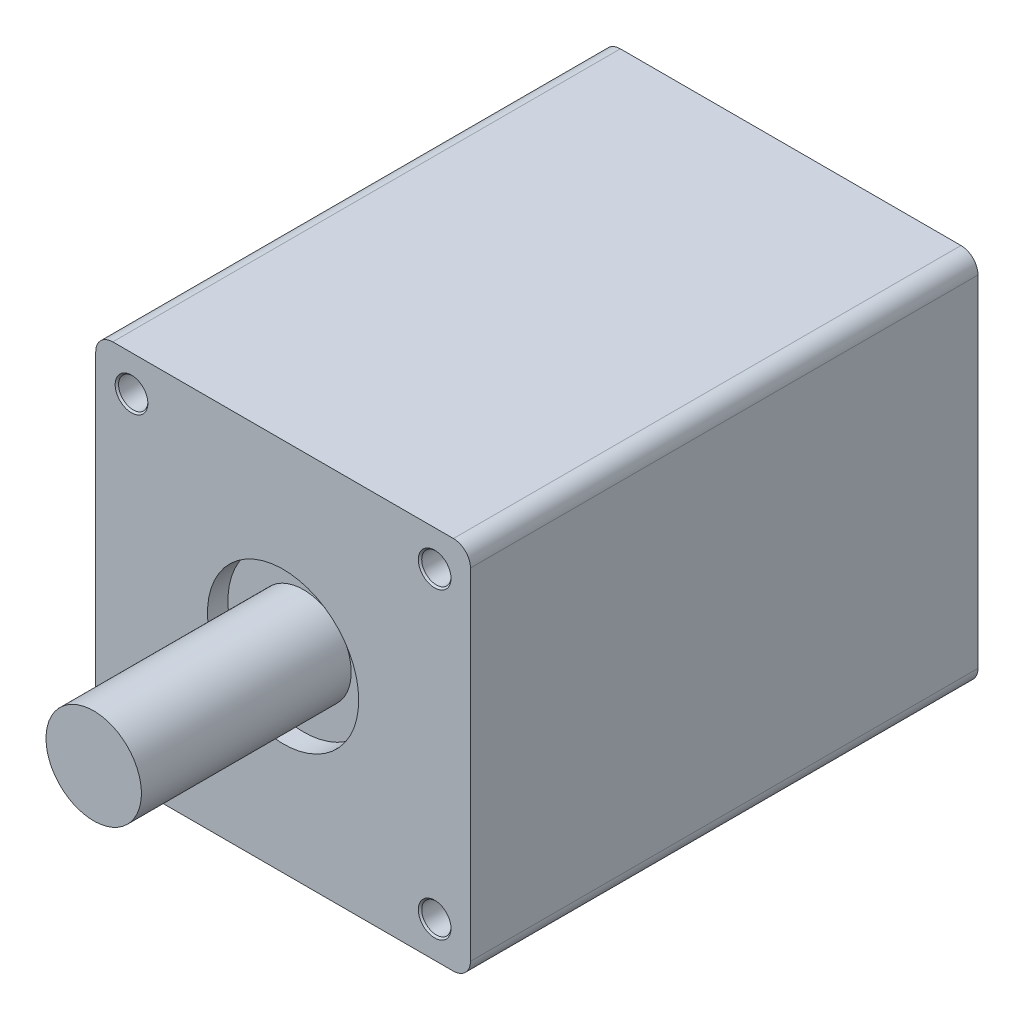
ISO-10303-21;
HEADER;
FILE_DESCRIPTION(('STEP AP214'),'2;1');
FILE_NAME('part.step','',(''),(''),'','','');
FILE_SCHEMA(('AUTOMOTIVE_DESIGN { 1 0 10303 214 1 1 1 1 }'));
ENDSEC;
DATA;
#1=APPLICATION_CONTEXT('core data for automotive mechanical design processes');
#2=APPLICATION_PROTOCOL_DEFINITION('international standard','automotive_design',2000,#1);
#3=PRODUCT_CONTEXT('',#1,'mechanical');
#4=PRODUCT('Part','Part','',(#3));
#5=PRODUCT_RELATED_PRODUCT_CATEGORY('part','',(#4));
#6=PRODUCT_DEFINITION_FORMATION('','',#4);
#7=PRODUCT_DEFINITION_CONTEXT('part definition',#1,'design');
#8=PRODUCT_DEFINITION('design','',#6,#7);
#9=PRODUCT_DEFINITION_SHAPE('','',#8);
#10=(LENGTH_UNIT() NAMED_UNIT(*) SI_UNIT(.MILLI.,.METRE.));
#11=(NAMED_UNIT(*) PLANE_ANGLE_UNIT() SI_UNIT($,.RADIAN.));
#12=(NAMED_UNIT(*) SI_UNIT($,.STERADIAN.) SOLID_ANGLE_UNIT());
#13=UNCERTAINTY_MEASURE_WITH_UNIT(LENGTH_MEASURE(1.E-05),#10,'distance_accuracy_value','');
#14=(GEOMETRIC_REPRESENTATION_CONTEXT(3) GLOBAL_UNCERTAINTY_ASSIGNED_CONTEXT((#13)) GLOBAL_UNIT_ASSIGNED_CONTEXT((#10,
#11,#12)) REPRESENTATION_CONTEXT('',''));
#15=CARTESIAN_POINT('',(0.,0.,0.));
#16=DIRECTION('',(0.,0.,1.));
#17=DIRECTION('',(1.,0.,0.));
#18=AXIS2_PLACEMENT_3D('',#15,#16,#17);
#19=CARTESIAN_POINT('',(50.,-50.,10.));
#20=DIRECTION('',(0.,0.,-1.));
#21=DIRECTION('',(-1.,0.,0.));
#22=AXIS2_PLACEMENT_3D('',#19,#20,#21);
#23=PLANE('',#22);
#24=CARTESIAN_POINT('',(-44.5,-44.5,10.));
#25=DIRECTION('',(0.,0.,-1.));
#26=DIRECTION('',(-1.,0.,0.));
#27=AXIS2_PLACEMENT_3D('',#24,#25,#26);
#28=CIRCLE('',#27,4.80000000000001);
#29=CARTESIAN_POINT('',(-49.3,-44.5,10.));
#30=VERTEX_POINT('',#29);
#31=EDGE_CURVE('E174',#30,#30,#28,.F.);
#32=ORIENTED_EDGE('',*,*,#31,.T.);
#33=EDGE_LOOP('',(#32));
#34=FACE_BOUND('',#33,.T.);
#35=ADVANCED_FACE('F59',(#34),#23,.F.);
#36=CARTESIAN_POINT('',(44.5,-44.5,10.));
#37=DIRECTION('',(0.,0.,1.));
#38=DIRECTION('',(1.,0.,0.));
#39=AXIS2_PLACEMENT_3D('',#36,#37,#38);
#40=CIRCLE('',#39,4.8);
#41=CARTESIAN_POINT('',(49.3,-44.5,10.));
#42=VERTEX_POINT('',#41);
#43=EDGE_CURVE('E195',#42,#42,#40,.T.);
#44=ORIENTED_EDGE('',*,*,#43,.T.);
#45=EDGE_LOOP('',(#44));
#46=FACE_BOUND('',#45,.T.);
#47=ADVANCED_FACE('F281',(#46),#23,.F.);
#48=CARTESIAN_POINT('',(44.5,44.5,10.));
#49=DIRECTION('',(0.,0.,-1.));
#50=DIRECTION('',(-1.,0.,0.));
#51=AXIS2_PLACEMENT_3D('',#48,#49,#50);
#52=CIRCLE('',#51,4.80000000000001);
#53=CARTESIAN_POINT('',(39.7,44.5,10.));
#54=VERTEX_POINT('',#53);
#55=EDGE_CURVE('E204',#54,#54,#52,.F.);
#56=ORIENTED_EDGE('',*,*,#55,.T.);
#57=EDGE_LOOP('',(#56));
#58=FACE_BOUND('',#57,.T.);
#59=ADVANCED_FACE('F288',(#58),#23,.F.);
#60=CARTESIAN_POINT('',(-44.5,44.5,10.));
#61=DIRECTION('',(0.,0.,1.));
#62=DIRECTION('',(1.,0.,0.));
#63=AXIS2_PLACEMENT_3D('',#60,#61,#62);
#64=CIRCLE('',#63,4.8);
#65=CARTESIAN_POINT('',(-39.7,44.5,10.));
#66=VERTEX_POINT('',#65);
#67=EDGE_CURVE('E213',#66,#66,#64,.T.);
#68=ORIENTED_EDGE('',*,*,#67,.T.);
#69=EDGE_LOOP('',(#68));
#70=FACE_BOUND('',#69,.T.);
#71=ADVANCED_FACE('F283',(#70),#23,.F.);
#72=CARTESIAN_POINT('',(-44.5,-44.5,10.5));
#73=DIRECTION('',(0.,0.,-1.));
#74=DIRECTION('',(-1.,0.,0.));
#75=AXIS2_PLACEMENT_3D('',#72,#73,#74);
#76=CONICAL_SURFACE('',#75,4.3,0.785398163397447);
#77=ORIENTED_EDGE('',*,*,#31,.F.);
#78=EDGE_LOOP('',(#77));
#79=FACE_BOUND('',#78,.T.);
#80=CARTESIAN_POINT('',(-44.5,-44.5,10.5));
#81=DIRECTION('',(0.,0.,-1.));
#82=DIRECTION('',(-1.,0.,0.));
#83=AXIS2_PLACEMENT_3D('',#80,#81,#82);
#84=CIRCLE('',#83,4.3);
#85=CARTESIAN_POINT('',(-48.8,-44.5,10.5));
#86=VERTEX_POINT('',#85);
#87=EDGE_CURVE('E171',#86,#86,#84,.T.);
#88=ORIENTED_EDGE('',*,*,#87,.F.);
#89=EDGE_LOOP('',(#88));
#90=FACE_BOUND('',#89,.T.);
#91=ADVANCED_FACE('F292',(#79,#90),#76,.F.);
#92=CARTESIAN_POINT('',(44.5,-44.5,10.));
#93=DIRECTION('',(0.,0.,-1.));
#94=DIRECTION('',(-1.,0.,0.));
#95=AXIS2_PLACEMENT_3D('',#92,#93,#94);
#96=CONICAL_SURFACE('',#95,4.8,0.785398163397461);
#97=CARTESIAN_POINT('',(44.5,-44.5,10.5));
#98=DIRECTION('',(0.,0.,1.));
#99=DIRECTION('',(1.,0.,0.));
#100=AXIS2_PLACEMENT_3D('',#97,#98,#99);
#101=CIRCLE('',#100,4.3);
#102=CARTESIAN_POINT('',(48.8,-44.5,10.5));
#103=VERTEX_POINT('',#102);
#104=EDGE_CURVE('E189',#103,#103,#101,.F.);
#105=ORIENTED_EDGE('',*,*,#104,.F.);
#106=EDGE_LOOP('',(#105));
#107=FACE_BOUND('',#106,.T.);
#108=ORIENTED_EDGE('',*,*,#43,.F.);
#109=EDGE_LOOP('',(#108));
#110=FACE_BOUND('',#109,.T.);
#111=ADVANCED_FACE('F298',(#107,#110),#96,.F.);
#112=CARTESIAN_POINT('',(44.5,44.5,10.5));
#113=DIRECTION('',(0.,0.,-1.));
#114=DIRECTION('',(-1.,0.,0.));
#115=AXIS2_PLACEMENT_3D('',#112,#113,#114);
#116=CONICAL_SURFACE('',#115,4.3,0.785398163397447);
#117=ORIENTED_EDGE('',*,*,#55,.F.);
#118=EDGE_LOOP('',(#117));
#119=FACE_BOUND('',#118,.T.);
#120=CARTESIAN_POINT('',(44.5,44.5,10.5));
#121=DIRECTION('',(0.,0.,-1.));
#122=DIRECTION('',(-1.,0.,0.));
#123=AXIS2_PLACEMENT_3D('',#120,#121,#122);
#124=CIRCLE('',#123,4.3);
#125=CARTESIAN_POINT('',(40.2,44.5,10.5));
#126=VERTEX_POINT('',#125);
#127=EDGE_CURVE('E201',#126,#126,#124,.T.);
#128=ORIENTED_EDGE('',*,*,#127,.F.);
#129=EDGE_LOOP('',(#128));
#130=FACE_BOUND('',#129,.T.);
#131=ADVANCED_FACE('F307',(#119,#130),#116,.F.);
#132=CARTESIAN_POINT('',(-44.5,44.5,10.));
#133=DIRECTION('',(0.,0.,-1.));
#134=DIRECTION('',(-1.,0.,0.));
#135=AXIS2_PLACEMENT_3D('',#132,#133,#134);
#136=CONICAL_SURFACE('',#135,4.8,0.785398163397461);
#137=CARTESIAN_POINT('',(-44.5,44.5,10.5));
#138=DIRECTION('',(0.,0.,1.));
#139=DIRECTION('',(1.,0.,0.));
#140=AXIS2_PLACEMENT_3D('',#137,#138,#139);
#141=CIRCLE('',#140,4.3);
#142=CARTESIAN_POINT('',(-40.2,44.5,10.5));
#143=VERTEX_POINT('',#142);
#144=EDGE_CURVE('E207',#143,#143,#141,.F.);
#145=ORIENTED_EDGE('',*,*,#144,.F.);
#146=EDGE_LOOP('',(#145));
#147=FACE_BOUND('',#146,.T.);
#148=ORIENTED_EDGE('',*,*,#67,.F.);
#149=EDGE_LOOP('',(#148));
#150=FACE_BOUND('',#149,.T.);
#151=ADVANCED_FACE('F304',(#147,#150),#136,.F.);
#152=CARTESIAN_POINT('',(-44.5,-44.5,22.));
#153=DIRECTION('',(0.,0.,-1.));
#154=DIRECTION('',(-1.,0.,0.));
#155=AXIS2_PLACEMENT_3D('',#152,#153,#154);
#156=CYLINDRICAL_SURFACE('',#155,4.3);
#157=ORIENTED_EDGE('',*,*,#87,.T.);
#158=EDGE_LOOP('',(#157));
#159=FACE_BOUND('',#158,.T.);
#160=CARTESIAN_POINT('',(-44.5,-44.5,21.5));
#161=DIRECTION('',(0.,0.,1.));
#162=DIRECTION('',(1.,0.,0.));
#163=AXIS2_PLACEMENT_3D('',#160,#161,#162);
#164=CIRCLE('',#163,4.3);
#165=CARTESIAN_POINT('',(-40.2,-44.5,21.5));
#166=VERTEX_POINT('',#165);
#167=EDGE_CURVE('E168',#166,#166,#164,.T.);
#168=ORIENTED_EDGE('',*,*,#167,.T.);
#169=EDGE_LOOP('',(#168));
#170=FACE_BOUND('',#169,.T.);
#171=ADVANCED_FACE('F306',(#159,#170),#156,.F.);
#172=CARTESIAN_POINT('',(44.5,-44.5,22.));
#173=DIRECTION('',(0.,0.,-1.));
#174=DIRECTION('',(-1.,0.,0.));
#175=AXIS2_PLACEMENT_3D('',#172,#173,#174);
#176=CYLINDRICAL_SURFACE('',#175,4.3);
#177=CARTESIAN_POINT('',(44.5,-44.5,21.5));
#178=DIRECTION('',(0.,0.,1.));
#179=DIRECTION('',(1.,0.,0.));
#180=AXIS2_PLACEMENT_3D('',#177,#178,#179);
#181=CIRCLE('',#180,4.3);
#182=CARTESIAN_POINT('',(48.8,-44.5,21.5));
#183=VERTEX_POINT('',#182);
#184=EDGE_CURVE('E192',#183,#183,#181,.T.);
#185=ORIENTED_EDGE('',*,*,#184,.T.);
#186=EDGE_LOOP('',(#185));
#187=FACE_BOUND('',#186,.T.);
#188=ORIENTED_EDGE('',*,*,#104,.T.);
#189=EDGE_LOOP('',(#188));
#190=FACE_BOUND('',#189,.T.);
#191=ADVANCED_FACE('F313',(#187,#190),#176,.F.);
#192=CARTESIAN_POINT('',(44.5,44.5,22.));
#193=DIRECTION('',(0.,0.,-1.));
#194=DIRECTION('',(-1.,0.,0.));
#195=AXIS2_PLACEMENT_3D('',#192,#193,#194);
#196=CYLINDRICAL_SURFACE('',#195,4.3);
#197=ORIENTED_EDGE('',*,*,#127,.T.);
#198=EDGE_LOOP('',(#197));
#199=FACE_BOUND('',#198,.T.);
#200=CARTESIAN_POINT('',(44.5,44.5,21.5));
#201=DIRECTION('',(0.,0.,1.));
#202=DIRECTION('',(1.,0.,0.));
#203=AXIS2_PLACEMENT_3D('',#200,#201,#202);
#204=CIRCLE('',#203,4.3);
#205=CARTESIAN_POINT('',(48.8,44.5,21.5));
#206=VERTEX_POINT('',#205);
#207=EDGE_CURVE('E198',#206,#206,#204,.T.);
#208=ORIENTED_EDGE('',*,*,#207,.T.);
#209=EDGE_LOOP('',(#208));
#210=FACE_BOUND('',#209,.T.);
#211=ADVANCED_FACE('F345',(#199,#210),#196,.F.);
#212=CARTESIAN_POINT('',(-44.5,44.5,22.));
#213=DIRECTION('',(0.,0.,-1.));
#214=DIRECTION('',(-1.,0.,0.));
#215=AXIS2_PLACEMENT_3D('',#212,#213,#214);
#216=CYLINDRICAL_SURFACE('',#215,4.3);
#217=CARTESIAN_POINT('',(-44.5,44.5,21.5));
#218=DIRECTION('',(0.,0.,1.));
#219=DIRECTION('',(1.,0.,0.));
#220=AXIS2_PLACEMENT_3D('',#217,#218,#219);
#221=CIRCLE('',#220,4.3);
#222=CARTESIAN_POINT('',(-40.2,44.5,21.5));
#223=VERTEX_POINT('',#222);
#224=EDGE_CURVE('E210',#223,#223,#221,.T.);
#225=ORIENTED_EDGE('',*,*,#224,.T.);
#226=EDGE_LOOP('',(#225));
#227=FACE_BOUND('',#226,.T.);
#228=ORIENTED_EDGE('',*,*,#144,.T.);
#229=EDGE_LOOP('',(#228));
#230=FACE_BOUND('',#229,.T.);
#231=ADVANCED_FACE('F342',(#227,#230),#216,.F.);
#232=CARTESIAN_POINT('',(-51.,-32.6,-127.));
#233=DIRECTION('',(0.,0.,-1.));
#234=DIRECTION('',(-1.,0.,0.));
#235=AXIS2_PLACEMENT_3D('',#232,#233,#234);
#236=PLANE('',#235);
#237=CARTESIAN_POINT('',(-50.,-50.,-127.));
#238=DIRECTION('',(0.,0.,-1.));
#239=DIRECTION('',(-1.,0.,0.));
#240=AXIS2_PLACEMENT_3D('',#237,#238,#239);
#241=CIRCLE('',#240,5.);
#242=CARTESIAN_POINT('',(-50.,-55.,-127.));
#243=VERTEX_POINT('',#242);
#244=CARTESIAN_POINT('',(-55.,-50.,-127.));
#245=VERTEX_POINT('',#244);
#246=EDGE_CURVE('E221',#243,#245,#241,.T.);
#247=ORIENTED_EDGE('',*,*,#246,.T.);
#248=DIRECTION('',(0.,1.,0.));
#249=VECTOR('',#248,1.);
#250=CARTESIAN_POINT('',(-55.,-32.6,-127.));
#251=LINE('',#250,#249);
#252=CARTESIAN_POINT('',(-55.,50.,-127.));
#253=VERTEX_POINT('',#252);
#254=EDGE_CURVE('E241',#245,#253,#251,.T.);
#255=ORIENTED_EDGE('',*,*,#254,.T.);
#256=CARTESIAN_POINT('',(-50.,50.,-127.));
#257=DIRECTION('',(0.,0.,-1.));
#258=DIRECTION('',(1.,0.,0.));
#259=AXIS2_PLACEMENT_3D('',#256,#257,#258);
#260=CIRCLE('',#259,5.);
#261=CARTESIAN_POINT('',(-50.,55.,-127.));
#262=VERTEX_POINT('',#261);
#263=EDGE_CURVE('E224',#253,#262,#260,.T.);
#264=ORIENTED_EDGE('',*,*,#263,.T.);
#265=DIRECTION('',(1.,0.,0.));
#266=VECTOR('',#265,1.);
#267=CARTESIAN_POINT('',(-32.6,55.,-127.));
#268=LINE('',#267,#266);
#269=CARTESIAN_POINT('',(50.,55.,-127.));
#270=VERTEX_POINT('',#269);
#271=EDGE_CURVE('E243',#262,#270,#268,.T.);
#272=ORIENTED_EDGE('',*,*,#271,.T.);
#273=CARTESIAN_POINT('',(50.,50.,-127.));
#274=DIRECTION('',(0.,0.,-1.));
#275=DIRECTION('',(-1.,0.,0.));
#276=AXIS2_PLACEMENT_3D('',#273,#274,#275);
#277=CIRCLE('',#276,5.);
#278=CARTESIAN_POINT('',(55.,50.,-127.));
#279=VERTEX_POINT('',#278);
#280=EDGE_CURVE('E130',#270,#279,#277,.T.);
#281=ORIENTED_EDGE('',*,*,#280,.T.);
#282=DIRECTION('',(0.,-1.,0.));
#283=VECTOR('',#282,1.);
#284=CARTESIAN_POINT('',(55.,32.6,-127.));
#285=LINE('',#284,#283);
#286=CARTESIAN_POINT('',(55.,-50.,-127.));
#287=VERTEX_POINT('',#286);
#288=EDGE_CURVE('E74',#279,#287,#285,.T.);
#289=ORIENTED_EDGE('',*,*,#288,.T.);
#290=CARTESIAN_POINT('',(50.,-50.,-127.));
#291=DIRECTION('',(0.,0.,-1.));
#292=DIRECTION('',(-1.,0.,0.));
#293=AXIS2_PLACEMENT_3D('',#290,#291,#292);
#294=CIRCLE('',#293,5.);
#295=CARTESIAN_POINT('',(50.,-55.,-127.));
#296=VERTEX_POINT('',#295);
#297=EDGE_CURVE('E128',#287,#296,#294,.T.);
#298=ORIENTED_EDGE('',*,*,#297,.T.);
#299=DIRECTION('',(-1.,0.,0.));
#300=VECTOR('',#299,1.);
#301=CARTESIAN_POINT('',(32.6,-55.,-127.));
#302=LINE('',#301,#300);
#303=EDGE_CURVE('E67',#296,#243,#302,.T.);
#304=ORIENTED_EDGE('',*,*,#303,.T.);
#305=EDGE_LOOP('',(#247,#255,#264,#272,#281,#289,#298,#304));
#306=FACE_BOUND('',#305,.T.);
#307=ADVANCED_FACE('F246',(#306),#236,.T.);
#308=CARTESIAN_POINT('',(-44.5,-44.5,21.5));
#309=DIRECTION('',(0.,0.,1.));
#310=DIRECTION('',(1.,0.,0.));
#311=AXIS2_PLACEMENT_3D('',#308,#309,#310);
#312=CONICAL_SURFACE('',#311,4.3,0.785398163397444);
#313=CARTESIAN_POINT('',(-44.5,-44.5,22.));
#314=DIRECTION('',(0.,0.,1.));
#315=DIRECTION('',(1.,0.,0.));
#316=AXIS2_PLACEMENT_3D('',#313,#314,#315);
#317=CIRCLE('',#316,4.80000000000003);
#318=CARTESIAN_POINT('',(-39.7,-44.5,22.));
#319=VERTEX_POINT('',#318);
#320=EDGE_CURVE('E186',#319,#319,#317,.F.);
#321=ORIENTED_EDGE('',*,*,#320,.F.);
#322=EDGE_LOOP('',(#321));
#323=FACE_BOUND('',#322,.T.);
#324=ORIENTED_EDGE('',*,*,#167,.F.);
#325=EDGE_LOOP('',(#324));
#326=FACE_BOUND('',#325,.T.);
#327=ADVANCED_FACE('F334',(#323,#326),#312,.F.);
#328=CARTESIAN_POINT('',(44.5,-44.5,21.5));
#329=DIRECTION('',(0.,0.,1.));
#330=DIRECTION('',(1.,0.,0.));
#331=AXIS2_PLACEMENT_3D('',#328,#329,#330);
#332=CONICAL_SURFACE('',#331,4.3,0.785398163397458);
#333=CARTESIAN_POINT('',(44.5,-44.5,22.));
#334=DIRECTION('',(0.,0.,1.));
#335=DIRECTION('',(1.,0.,0.));
#336=AXIS2_PLACEMENT_3D('',#333,#334,#335);
#337=CIRCLE('',#336,4.8);
#338=CARTESIAN_POINT('',(49.3,-44.5,22.));
#339=VERTEX_POINT('',#338);
#340=EDGE_CURVE('E183',#339,#339,#337,.F.);
#341=ORIENTED_EDGE('',*,*,#340,.F.);
#342=EDGE_LOOP('',(#341));
#343=FACE_BOUND('',#342,.T.);
#344=ORIENTED_EDGE('',*,*,#184,.F.);
#345=EDGE_LOOP('',(#344));
#346=FACE_BOUND('',#345,.T.);
#347=ADVANCED_FACE('F326',(#343,#346),#332,.F.);
#348=CARTESIAN_POINT('',(44.5,44.5,21.5));
#349=DIRECTION('',(0.,0.,1.));
#350=DIRECTION('',(1.,0.,0.));
#351=AXIS2_PLACEMENT_3D('',#348,#349,#350);
#352=CONICAL_SURFACE('',#351,4.3,0.785398163397458);
#353=CARTESIAN_POINT('',(44.5,44.5,22.));
#354=DIRECTION('',(0.,0.,1.));
#355=DIRECTION('',(1.,0.,0.));
#356=AXIS2_PLACEMENT_3D('',#353,#354,#355);
#357=CIRCLE('',#356,4.8);
#358=CARTESIAN_POINT('',(49.3,44.5,22.));
#359=VERTEX_POINT('',#358);
#360=EDGE_CURVE('E180',#359,#359,#357,.F.);
#361=ORIENTED_EDGE('',*,*,#360,.F.);
#362=EDGE_LOOP('',(#361));
#363=FACE_BOUND('',#362,.T.);
#364=ORIENTED_EDGE('',*,*,#207,.F.);
#365=EDGE_LOOP('',(#364));
#366=FACE_BOUND('',#365,.T.);
#367=ADVANCED_FACE('F323',(#363,#366),#352,.F.);
#368=CARTESIAN_POINT('',(-44.5,44.5,21.5));
#369=DIRECTION('',(0.,0.,1.));
#370=DIRECTION('',(1.,0.,0.));
#371=AXIS2_PLACEMENT_3D('',#368,#369,#370);
#372=CONICAL_SURFACE('',#371,4.3,0.785398163397458);
#373=CARTESIAN_POINT('',(-44.5,44.5,22.));
#374=DIRECTION('',(0.,0.,1.));
#375=DIRECTION('',(1.,0.,0.));
#376=AXIS2_PLACEMENT_3D('',#373,#374,#375);
#377=CIRCLE('',#376,4.8);
#378=CARTESIAN_POINT('',(-39.7,44.5,22.));
#379=VERTEX_POINT('',#378);
#380=EDGE_CURVE('E177',#379,#379,#377,.F.);
#381=ORIENTED_EDGE('',*,*,#380,.F.);
#382=EDGE_LOOP('',(#381));
#383=FACE_BOUND('',#382,.T.);
#384=ORIENTED_EDGE('',*,*,#224,.F.);
#385=EDGE_LOOP('',(#384));
#386=FACE_BOUND('',#385,.T.);
#387=ADVANCED_FACE('F320',(#383,#386),#372,.F.);
#388=CARTESIAN_POINT('',(-50.,50.,-127.));
#389=DIRECTION('',(0.,0.,1.));
#390=DIRECTION('',(1.,0.,0.));
#391=AXIS2_PLACEMENT_3D('',#388,#389,#390);
#392=CYLINDRICAL_SURFACE('',#391,5.);
#393=DIRECTION('',(0.,0.,1.));
#394=VECTOR('',#393,1.);
#395=CARTESIAN_POINT('',(-55.,50.,-127.));
#396=LINE('',#395,#394);
#397=CARTESIAN_POINT('',(-55.,50.,22.));
#398=VERTEX_POINT('',#397);
#399=EDGE_CURVE('E233',#253,#398,#396,.T.);
#400=ORIENTED_EDGE('',*,*,#399,.T.);
#401=CARTESIAN_POINT('',(-50.,50.,22.));
#402=DIRECTION('',(0.,0.,1.));
#403=DIRECTION('',(1.,0.,0.));
#404=AXIS2_PLACEMENT_3D('',#401,#402,#403);
#405=CIRCLE('',#404,5.);
#406=CARTESIAN_POINT('',(-50.,55.,22.));
#407=VERTEX_POINT('',#406);
#408=EDGE_CURVE('E160',#407,#398,#405,.T.);
#409=ORIENTED_EDGE('',*,*,#408,.F.);
#410=DIRECTION('',(0.,0.,1.));
#411=VECTOR('',#410,1.);
#412=CARTESIAN_POINT('',(-50.,55.,-127.));
#413=LINE('',#412,#411);
#414=EDGE_CURVE('E231',#262,#407,#413,.T.);
#415=ORIENTED_EDGE('',*,*,#414,.F.);
#416=ORIENTED_EDGE('',*,*,#263,.F.);
#417=EDGE_LOOP('',(#400,#409,#415,#416));
#418=FACE_BOUND('',#417,.T.);
#419=ADVANCED_FACE('F262',(#418),#392,.T.);
#420=CARTESIAN_POINT('',(-32.6,55.,-127.));
#421=DIRECTION('',(0.,-1.,0.));
#422=DIRECTION('',(0.,0.,-1.));
#423=AXIS2_PLACEMENT_3D('',#420,#421,#422);
#424=PLANE('',#423);
#425=DIRECTION('',(0.,0.,1.));
#426=VECTOR('',#425,1.);
#427=CARTESIAN_POINT('',(50.,55.,-127.));
#428=LINE('',#427,#426);
#429=CARTESIAN_POINT('',(50.,55.,22.));
#430=VERTEX_POINT('',#429);
#431=EDGE_CURVE('E229',#270,#430,#428,.T.);
#432=ORIENTED_EDGE('',*,*,#431,.F.);
#433=ORIENTED_EDGE('',*,*,#271,.F.);
#434=ORIENTED_EDGE('',*,*,#414,.T.);
#435=DIRECTION('',(-1.,0.,0.));
#436=VECTOR('',#435,1.);
#437=CARTESIAN_POINT('',(50.,55.,22.));
#438=LINE('',#437,#436);
#439=EDGE_CURVE('E157',#430,#407,#438,.T.);
#440=ORIENTED_EDGE('',*,*,#439,.F.);
#441=EDGE_LOOP('',(#432,#433,#434,#440));
#442=FACE_BOUND('',#441,.T.);
#443=ADVANCED_FACE('F267',(#442),#424,.F.);
#444=CARTESIAN_POINT('',(50.,50.,-127.));
#445=DIRECTION('',(0.,0.,1.));
#446=DIRECTION('',(1.,0.,0.));
#447=AXIS2_PLACEMENT_3D('',#444,#445,#446);
#448=CYLINDRICAL_SURFACE('',#447,5.);
#449=ORIENTED_EDGE('',*,*,#431,.T.);
#450=CARTESIAN_POINT('',(50.,50.,22.));
#451=DIRECTION('',(0.,0.,1.));
#452=DIRECTION('',(1.,0.,0.));
#453=AXIS2_PLACEMENT_3D('',#450,#451,#452);
#454=CIRCLE('',#453,5.);
#455=CARTESIAN_POINT('',(55.,50.,22.));
#456=VERTEX_POINT('',#455);
#457=EDGE_CURVE('E139',#456,#430,#454,.T.);
#458=ORIENTED_EDGE('',*,*,#457,.F.);
#459=DIRECTION('',(0.,0.,1.));
#460=VECTOR('',#459,1.);
#461=CARTESIAN_POINT('',(55.,50.,-127.));
#462=LINE('',#461,#460);
#463=EDGE_CURVE('E129',#279,#456,#462,.T.);
#464=ORIENTED_EDGE('',*,*,#463,.F.);
#465=ORIENTED_EDGE('',*,*,#280,.F.);
#466=EDGE_LOOP('',(#449,#458,#464,#465));
#467=FACE_BOUND('',#466,.T.);
#468=ADVANCED_FACE('F269',(#467),#448,.T.);
#469=CARTESIAN_POINT('',(55.,32.6,-127.));
#470=DIRECTION('',(-1.,0.,0.));
#471=DIRECTION('',(0.,-1.,0.));
#472=AXIS2_PLACEMENT_3D('',#469,#470,#471);
#473=PLANE('',#472);
#474=DIRECTION('',(0.,1.,0.));
#475=VECTOR('',#474,1.);
#476=CARTESIAN_POINT('',(55.,-50.,22.));
#477=LINE('',#476,#475);
#478=CARTESIAN_POINT('',(55.,-50.,22.));
#479=VERTEX_POINT('',#478);
#480=EDGE_CURVE('E133',#479,#456,#477,.T.);
#481=ORIENTED_EDGE('',*,*,#480,.F.);
#482=DIRECTION('',(0.,0.,1.));
#483=VECTOR('',#482,1.);
#484=CARTESIAN_POINT('',(55.,-50.,-127.));
#485=LINE('',#484,#483);
#486=EDGE_CURVE('E122',#287,#479,#485,.T.);
#487=ORIENTED_EDGE('',*,*,#486,.F.);
#488=ORIENTED_EDGE('',*,*,#288,.F.);
#489=ORIENTED_EDGE('',*,*,#463,.T.);
#490=EDGE_LOOP('',(#481,#487,#488,#489));
#491=FACE_BOUND('',#490,.T.);
#492=ADVANCED_FACE('F134',(#491),#473,.F.);
#493=CARTESIAN_POINT('',(50.,-50.,-127.));
#494=DIRECTION('',(0.,0.,1.));
#495=DIRECTION('',(1.,0.,0.));
#496=AXIS2_PLACEMENT_3D('',#493,#494,#495);
#497=CYLINDRICAL_SURFACE('',#496,5.);
#498=ORIENTED_EDGE('',*,*,#486,.T.);
#499=CARTESIAN_POINT('',(50.,-50.,22.));
#500=DIRECTION('',(0.,0.,1.));
#501=DIRECTION('',(1.,0.,0.));
#502=AXIS2_PLACEMENT_3D('',#499,#500,#501);
#503=CIRCLE('',#502,5.);
#504=CARTESIAN_POINT('',(50.,-55.,22.));
#505=VERTEX_POINT('',#504);
#506=EDGE_CURVE('E127',#505,#479,#503,.T.);
#507=ORIENTED_EDGE('',*,*,#506,.F.);
#508=DIRECTION('',(0.,0.,1.));
#509=VECTOR('',#508,1.);
#510=CARTESIAN_POINT('',(50.,-55.,-127.));
#511=LINE('',#510,#509);
#512=EDGE_CURVE('E239',#296,#505,#511,.T.);
#513=ORIENTED_EDGE('',*,*,#512,.F.);
#514=ORIENTED_EDGE('',*,*,#297,.F.);
#515=EDGE_LOOP('',(#498,#507,#513,#514));
#516=FACE_BOUND('',#515,.T.);
#517=ADVANCED_FACE('F124',(#516),#497,.T.);
#518=CARTESIAN_POINT('',(32.6,-55.,-127.));
#519=DIRECTION('',(0.,1.,0.));
#520=DIRECTION('',(0.,0.,1.));
#521=AXIS2_PLACEMENT_3D('',#518,#519,#520);
#522=PLANE('',#521);
#523=ORIENTED_EDGE('',*,*,#512,.T.);
#524=DIRECTION('',(1.,0.,0.));
#525=VECTOR('',#524,1.);
#526=CARTESIAN_POINT('',(50.,-55.,22.));
#527=LINE('',#526,#525);
#528=CARTESIAN_POINT('',(-50.,-55.,22.));
#529=VERTEX_POINT('',#528);
#530=EDGE_CURVE('E147',#529,#505,#527,.T.);
#531=ORIENTED_EDGE('',*,*,#530,.F.);
#532=DIRECTION('',(0.,0.,1.));
#533=VECTOR('',#532,1.);
#534=CARTESIAN_POINT('',(-50.,-55.,-127.));
#535=LINE('',#534,#533);
#536=EDGE_CURVE('E237',#243,#529,#535,.T.);
#537=ORIENTED_EDGE('',*,*,#536,.F.);
#538=ORIENTED_EDGE('',*,*,#303,.F.);
#539=EDGE_LOOP('',(#523,#531,#537,#538));
#540=FACE_BOUND('',#539,.T.);
#541=ADVANCED_FACE('F250',(#540),#522,.F.);
#542=CARTESIAN_POINT('',(-50.,-50.,-127.));
#543=DIRECTION('',(0.,0.,1.));
#544=DIRECTION('',(1.,0.,0.));
#545=AXIS2_PLACEMENT_3D('',#542,#543,#544);
#546=CYLINDRICAL_SURFACE('',#545,5.);
#547=ORIENTED_EDGE('',*,*,#536,.T.);
#548=CARTESIAN_POINT('',(-50.,-50.,22.));
#549=DIRECTION('',(0.,0.,1.));
#550=DIRECTION('',(-1.,0.,0.));
#551=AXIS2_PLACEMENT_3D('',#548,#549,#550);
#552=CIRCLE('',#551,5.);
#553=CARTESIAN_POINT('',(-55.,-50.,22.));
#554=VERTEX_POINT('',#553);
#555=EDGE_CURVE('E165',#554,#529,#552,.T.);
#556=ORIENTED_EDGE('',*,*,#555,.F.);
#557=DIRECTION('',(0.,0.,1.));
#558=VECTOR('',#557,1.);
#559=CARTESIAN_POINT('',(-55.,-50.,-127.));
#560=LINE('',#559,#558);
#561=EDGE_CURVE('E235',#245,#554,#560,.T.);
#562=ORIENTED_EDGE('',*,*,#561,.F.);
#563=ORIENTED_EDGE('',*,*,#246,.F.);
#564=EDGE_LOOP('',(#547,#556,#562,#563));
#565=FACE_BOUND('',#564,.T.);
#566=ADVANCED_FACE('F253',(#565),#546,.T.);
#567=CARTESIAN_POINT('',(-55.,-32.6,-127.));
#568=DIRECTION('',(1.,0.,0.));
#569=DIRECTION('',(0.,1.,0.));
#570=AXIS2_PLACEMENT_3D('',#567,#568,#569);
#571=PLANE('',#570);
#572=ORIENTED_EDGE('',*,*,#561,.T.);
#573=DIRECTION('',(0.,-1.,0.));
#574=VECTOR('',#573,1.);
#575=CARTESIAN_POINT('',(-55.,-50.,22.));
#576=LINE('',#575,#574);
#577=EDGE_CURVE('E163',#398,#554,#576,.T.);
#578=ORIENTED_EDGE('',*,*,#577,.F.);
#579=ORIENTED_EDGE('',*,*,#399,.F.);
#580=ORIENTED_EDGE('',*,*,#254,.F.);
#581=EDGE_LOOP('',(#572,#578,#579,#580));
#582=FACE_BOUND('',#581,.T.);
#583=ADVANCED_FACE('F256',(#582),#571,.F.);
#584=CARTESIAN_POINT('',(50.,-50.,22.));
#585=DIRECTION('',(0.,0.,1.));
#586=DIRECTION('',(1.,0.,0.));
#587=AXIS2_PLACEMENT_3D('',#584,#585,#586);
#588=PLANE('',#587);
#589=ORIENTED_EDGE('',*,*,#577,.T.);
#590=ORIENTED_EDGE('',*,*,#555,.T.);
#591=ORIENTED_EDGE('',*,*,#530,.T.);
#592=ORIENTED_EDGE('',*,*,#506,.T.);
#593=ORIENTED_EDGE('',*,*,#480,.T.);
#594=ORIENTED_EDGE('',*,*,#457,.T.);
#595=ORIENTED_EDGE('',*,*,#439,.T.);
#596=ORIENTED_EDGE('',*,*,#408,.T.);
#597=EDGE_LOOP('',(#589,#590,#591,#592,#593,#594,#595,#596));
#598=FACE_BOUND('',#597,.T.);
#599=ORIENTED_EDGE('',*,*,#380,.T.);
#600=EDGE_LOOP('',(#599));
#601=FACE_BOUND('',#600,.T.);
#602=ORIENTED_EDGE('',*,*,#360,.T.);
#603=EDGE_LOOP('',(#602));
#604=FACE_BOUND('',#603,.T.);
#605=ORIENTED_EDGE('',*,*,#340,.T.);
#606=EDGE_LOOP('',(#605));
#607=FACE_BOUND('',#606,.T.);
#608=ORIENTED_EDGE('',*,*,#320,.T.);
#609=EDGE_LOOP('',(#608));
#610=FACE_BOUND('',#609,.T.);
#611=CARTESIAN_POINT('',(0.,0.,22.));
#612=DIRECTION('',(0.,0.,1.));
#613=DIRECTION('',(1.,0.,0.));
#614=AXIS2_PLACEMENT_3D('',#611,#612,#613);
#615=CIRCLE('',#614,22.2);
#616=CARTESIAN_POINT('',(22.2,0.,22.));
#617=VERTEX_POINT('',#616);
#618=EDGE_CURVE('E152',#617,#617,#615,.T.);
#619=ORIENTED_EDGE('',*,*,#618,.F.);
#620=EDGE_LOOP('',(#619));
#621=FACE_BOUND('',#620,.T.);
#622=ADVANCED_FACE('F143',(#598,#601,#604,#607,#610,#621),#588,.T.);
#623=CARTESIAN_POINT('',(0.,0.,77.6));
#624=DIRECTION('',(0.,0.,1.));
#625=DIRECTION('',(1.,0.,0.));
#626=AXIS2_PLACEMENT_3D('',#623,#624,#625);
#627=PLANE('',#626);
#628=CARTESIAN_POINT('',(0.,0.,77.6));
#629=DIRECTION('',(0.,0.,1.));
#630=DIRECTION('',(1.,0.,0.));
#631=AXIS2_PLACEMENT_3D('',#628,#629,#630);
#632=CIRCLE('',#631,14.);
#633=CARTESIAN_POINT('',(-14.,0.,77.6));
#634=VERTEX_POINT('',#633);
#635=EDGE_CURVE('E12',#634,#634,#632,.T.);
#636=ORIENTED_EDGE('',*,*,#635,.T.);
#637=EDGE_LOOP('',(#636));
#638=FACE_BOUND('',#637,.T.);
#639=ADVANCED_FACE('F341',(#638),#627,.T.);
#640=CARTESIAN_POINT('',(0.,0.,77.6));
#641=DIRECTION('',(0.,0.,-1.));
#642=DIRECTION('',(-1.,0.,0.));
#643=AXIS2_PLACEMENT_3D('',#640,#641,#642);
#644=CYLINDRICAL_SURFACE('',#643,14.);
#645=CARTESIAN_POINT('',(0.,0.,16.));
#646=DIRECTION('',(0.,0.,-1.));
#647=DIRECTION('',(-1.,0.,0.));
#648=AXIS2_PLACEMENT_3D('',#645,#646,#647);
#649=CIRCLE('',#648,14.);
#650=CARTESIAN_POINT('',(-14.,0.,16.));
#651=VERTEX_POINT('',#650);
#652=EDGE_CURVE('E216',#651,#651,#649,.F.);
#653=CARTESIAN_POINT('',(-14.,0.,77.6));
#654=CARTESIAN_POINT('',(-14.,0.,76.9583333333333));
#655=CARTESIAN_POINT('',(-14.,0.,76.3166666666667));
#656=CARTESIAN_POINT('',(-14.,0.,75.0333333333333));
#657=CARTESIAN_POINT('',(-14.,0.,74.3916666666667));
#658=CARTESIAN_POINT('',(-14.,0.,73.1083333333333));
#659=CARTESIAN_POINT('',(-14.,0.,72.4666666666667));
#660=CARTESIAN_POINT('',(-14.,0.,71.1833333333333));
#661=CARTESIAN_POINT('',(-14.,0.,70.5416666666667));
#662=CARTESIAN_POINT('',(-14.,0.,69.2583333333333));
#663=CARTESIAN_POINT('',(-14.,0.,68.6166666666667));
#664=CARTESIAN_POINT('',(-14.,0.,67.3333333333333));
#665=CARTESIAN_POINT('',(-14.,0.,66.6916666666667));
#666=CARTESIAN_POINT('',(-14.,0.,65.4083333333333));
#667=CARTESIAN_POINT('',(-14.,0.,64.7666666666667));
#668=CARTESIAN_POINT('',(-14.,0.,63.4833333333333));
#669=CARTESIAN_POINT('',(-14.,0.,62.8416666666667));
#670=CARTESIAN_POINT('',(-14.,0.,61.5583333333333));
#671=CARTESIAN_POINT('',(-14.,0.,60.9166666666667));
#672=CARTESIAN_POINT('',(-14.,0.,59.6333333333333));
#673=CARTESIAN_POINT('',(-14.,0.,58.9916666666667));
#674=CARTESIAN_POINT('',(-14.,0.,57.7083333333333));
#675=CARTESIAN_POINT('',(-14.,0.,57.0666666666667));
#676=CARTESIAN_POINT('',(-14.,0.,55.7833333333333));
#677=CARTESIAN_POINT('',(-14.,0.,55.1416666666667));
#678=CARTESIAN_POINT('',(-14.,0.,53.8583333333333));
#679=CARTESIAN_POINT('',(-14.,0.,53.2166666666667));
#680=CARTESIAN_POINT('',(-14.,0.,51.9333333333333));
#681=CARTESIAN_POINT('',(-14.,0.,51.2916666666667));
#682=CARTESIAN_POINT('',(-14.,0.,50.0083333333333));
#683=CARTESIAN_POINT('',(-14.,0.,49.3666666666667));
#684=CARTESIAN_POINT('',(-14.,0.,48.0833333333333));
#685=CARTESIAN_POINT('',(-14.,0.,47.4416666666667));
#686=CARTESIAN_POINT('',(-14.,0.,46.1583333333333));
#687=CARTESIAN_POINT('',(-14.,0.,45.5166666666667));
#688=CARTESIAN_POINT('',(-14.,0.,44.2333333333333));
#689=CARTESIAN_POINT('',(-14.,0.,43.5916666666667));
#690=CARTESIAN_POINT('',(-14.,0.,42.3083333333333));
#691=CARTESIAN_POINT('',(-14.,0.,41.6666666666667));
#692=CARTESIAN_POINT('',(-14.,0.,40.3833333333333));
#693=CARTESIAN_POINT('',(-14.,0.,39.7416666666667));
#694=CARTESIAN_POINT('',(-14.,0.,38.4583333333333));
#695=CARTESIAN_POINT('',(-14.,0.,37.8166666666667));
#696=CARTESIAN_POINT('',(-14.,0.,36.5333333333333));
#697=CARTESIAN_POINT('',(-14.,0.,35.8916666666667));
#698=CARTESIAN_POINT('',(-14.,0.,34.6083333333333));
#699=CARTESIAN_POINT('',(-14.,0.,33.9666666666667));
#700=CARTESIAN_POINT('',(-14.,0.,32.6833333333333));
#701=CARTESIAN_POINT('',(-14.,0.,32.0416666666667));
#702=CARTESIAN_POINT('',(-14.,0.,30.7583333333333));
#703=CARTESIAN_POINT('',(-14.,0.,30.1166666666667));
#704=CARTESIAN_POINT('',(-14.,0.,28.8333333333333));
#705=CARTESIAN_POINT('',(-14.,0.,28.1916666666667));
#706=CARTESIAN_POINT('',(-14.,0.,26.9083333333333));
#707=CARTESIAN_POINT('',(-14.,0.,26.2666666666667));
#708=CARTESIAN_POINT('',(-14.,0.,24.9833333333333));
#709=CARTESIAN_POINT('',(-14.,0.,24.3416666666667));
#710=CARTESIAN_POINT('',(-14.,0.,23.0583333333333));
#711=CARTESIAN_POINT('',(-14.,0.,22.4166666666667));
#712=CARTESIAN_POINT('',(-14.,0.,21.1333333333333));
#713=CARTESIAN_POINT('',(-14.,0.,20.4916666666667));
#714=CARTESIAN_POINT('',(-14.,0.,19.2083333333333));
#715=CARTESIAN_POINT('',(-14.,0.,18.5666666666667));
#716=CARTESIAN_POINT('',(-14.,0.,17.2833333333333));
#717=CARTESIAN_POINT('',(-14.,0.,16.6416666666667));
#718=CARTESIAN_POINT('',(-14.,0.,16.));
#719=B_SPLINE_CURVE_WITH_KNOTS('',3,(#653,#654,#655,#656,#657,#658,#659,#660,#661,#662,#663,
#664,#665,#666,#667,#668,#669,#670,#671,#672,#673,#674,#675,#676,#677,#678,#679,#680,#681,#682,
#683,#684,#685,#686,#687,#688,#689,#690,#691,#692,#693,#694,#695,#696,#697,#698,#699,#700,#701,
#702,#703,#704,#705,#706,#707,#708,#709,#710,#711,#712,#713,#714,#715,#716,#717,#718),
.UNSPECIFIED.,.F.,.F.,(4,2,2,2,2,2,2,2,2,2,2,2,2,2,2,2,2,2,2,2,2,2,2,2,2,2,2,2,2,2,2,2,4),(0.,
1.925,3.84999999999999,5.77499999999999,7.7,9.62499999999999,11.55,13.475,15.4,17.325,19.25,
21.175,23.1,25.025,26.95,28.875,30.8,32.725,34.65,36.575,38.5,40.425,42.35,44.275,46.2,48.125,
50.05,51.975,53.9,55.825,57.75,59.675,61.6),.UNSPECIFIED.);
#720=EDGE_CURVE('BSEAM61',#634,#651,#719,.T.);
#721=ORIENTED_EDGE('',*,*,#635,.F.);
#722=ORIENTED_EDGE('',*,*,#652,.T.);
#723=ORIENTED_EDGE('',*,*,#720,.T.);
#724=ORIENTED_EDGE('',*,*,#720,.F.);
#725=EDGE_LOOP('',(#721,#723,#722,#724));
#726=FACE_BOUND('',#725,.T.);
#727=ADVANCED_FACE('F61',(#726),#644,.T.);
#728=CARTESIAN_POINT('',(0.,23.3,16.));
#729=DIRECTION('',(0.,0.,-1.));
#730=DIRECTION('',(-1.,0.,0.));
#731=AXIS2_PLACEMENT_3D('',#728,#729,#730);
#732=PLANE('',#731);
#733=CARTESIAN_POINT('',(0.,0.,16.));
#734=DIRECTION('',(0.,0.,-1.));
#735=DIRECTION('',(-1.,0.,0.));
#736=AXIS2_PLACEMENT_3D('',#733,#734,#735);
#737=CIRCLE('',#736,22.2);
#738=CARTESIAN_POINT('',(22.2,0.,16.));
#739=VERTEX_POINT('',#738);
#740=EDGE_CURVE('E148',#739,#739,#737,.F.);
#741=ORIENTED_EDGE('',*,*,#740,.T.);
#742=EDGE_LOOP('',(#741));
#743=FACE_BOUND('',#742,.T.);
#744=ORIENTED_EDGE('',*,*,#652,.F.);
#745=EDGE_LOOP('',(#744));
#746=FACE_BOUND('',#745,.T.);
#747=ADVANCED_FACE('F353',(#743,#746),#732,.F.);
#748=CARTESIAN_POINT('',(0.,0.,-127.002));
#749=DIRECTION('',(0.,0.,1.));
#750=DIRECTION('',(1.,0.,0.));
#751=AXIS2_PLACEMENT_3D('',#748,#749,#750);
#752=CYLINDRICAL_SURFACE('',#751,22.2);
#753=CARTESIAN_POINT('',(22.2,0.,16.));
#754=CARTESIAN_POINT('',(22.2,0.,16.0625));
#755=CARTESIAN_POINT('',(22.2,0.,16.125));
#756=CARTESIAN_POINT('',(22.2,0.,16.25));
#757=CARTESIAN_POINT('',(22.2,0.,16.3125));
#758=CARTESIAN_POINT('',(22.2,0.,16.4375));
#759=CARTESIAN_POINT('',(22.2,0.,16.5));
#760=CARTESIAN_POINT('',(22.2,0.,16.625));
#761=CARTESIAN_POINT('',(22.2,0.,16.6875));
#762=CARTESIAN_POINT('',(22.2,0.,16.8125));
#763=CARTESIAN_POINT('',(22.2,0.,16.875));
#764=CARTESIAN_POINT('',(22.2,0.,17.));
#765=CARTESIAN_POINT('',(22.2,0.,17.0625));
#766=CARTESIAN_POINT('',(22.2,0.,17.1875));
#767=CARTESIAN_POINT('',(22.2,0.,17.25));
#768=CARTESIAN_POINT('',(22.2,0.,17.375));
#769=CARTESIAN_POINT('',(22.2,0.,17.4375));
#770=CARTESIAN_POINT('',(22.2,0.,17.5625));
#771=CARTESIAN_POINT('',(22.2,0.,17.625));
#772=CARTESIAN_POINT('',(22.2,0.,17.75));
#773=CARTESIAN_POINT('',(22.2,0.,17.8125));
#774=CARTESIAN_POINT('',(22.2,0.,17.9375));
#775=CARTESIAN_POINT('',(22.2,0.,18.));
#776=CARTESIAN_POINT('',(22.2,0.,18.125));
#777=CARTESIAN_POINT('',(22.2,0.,18.1875));
#778=CARTESIAN_POINT('',(22.2,0.,18.3125));
#779=CARTESIAN_POINT('',(22.2,0.,18.375));
#780=CARTESIAN_POINT('',(22.2,0.,18.5));
#781=CARTESIAN_POINT('',(22.2,0.,18.5625));
#782=CARTESIAN_POINT('',(22.2,0.,18.6875));
#783=CARTESIAN_POINT('',(22.2,0.,18.75));
#784=CARTESIAN_POINT('',(22.2,0.,18.875));
#785=CARTESIAN_POINT('',(22.2,0.,18.9375));
#786=CARTESIAN_POINT('',(22.2,0.,19.0625));
#787=CARTESIAN_POINT('',(22.2,0.,19.125));
#788=CARTESIAN_POINT('',(22.2,0.,19.25));
#789=CARTESIAN_POINT('',(22.2,0.,19.3125));
#790=CARTESIAN_POINT('',(22.2,0.,19.4375));
#791=CARTESIAN_POINT('',(22.2,0.,19.5));
#792=CARTESIAN_POINT('',(22.2,0.,19.625));
#793=CARTESIAN_POINT('',(22.2,0.,19.6875));
#794=CARTESIAN_POINT('',(22.2,0.,19.8125));
#795=CARTESIAN_POINT('',(22.2,0.,19.875));
#796=CARTESIAN_POINT('',(22.2,0.,20.));
#797=CARTESIAN_POINT('',(22.2,0.,20.0625));
#798=CARTESIAN_POINT('',(22.2,0.,20.1875));
#799=CARTESIAN_POINT('',(22.2,0.,20.25));
#800=CARTESIAN_POINT('',(22.2,0.,20.375));
#801=CARTESIAN_POINT('',(22.2,0.,20.4375));
#802=CARTESIAN_POINT('',(22.2,0.,20.5625));
#803=CARTESIAN_POINT('',(22.2,0.,20.625));
#804=CARTESIAN_POINT('',(22.2,0.,20.75));
#805=CARTESIAN_POINT('',(22.2,0.,20.8125));
#806=CARTESIAN_POINT('',(22.2,0.,20.9375));
#807=CARTESIAN_POINT('',(22.2,0.,21.));
#808=CARTESIAN_POINT('',(22.2,0.,21.125));
#809=CARTESIAN_POINT('',(22.2,0.,21.1875));
#810=CARTESIAN_POINT('',(22.2,0.,21.3125));
#811=CARTESIAN_POINT('',(22.2,0.,21.375));
#812=CARTESIAN_POINT('',(22.2,0.,21.5));
#813=CARTESIAN_POINT('',(22.2,0.,21.5625));
#814=CARTESIAN_POINT('',(22.2,0.,21.6875));
#815=CARTESIAN_POINT('',(22.2,0.,21.75));
#816=CARTESIAN_POINT('',(22.2,0.,21.875));
#817=CARTESIAN_POINT('',(22.2,0.,21.9375));
#818=CARTESIAN_POINT('',(22.2,0.,22.));
#819=B_SPLINE_CURVE_WITH_KNOTS('',3,(#753,#754,#755,#756,#757,#758,#759,#760,#761,#762,#763,
#764,#765,#766,#767,#768,#769,#770,#771,#772,#773,#774,#775,#776,#777,#778,#779,#780,#781,#782,
#783,#784,#785,#786,#787,#788,#789,#790,#791,#792,#793,#794,#795,#796,#797,#798,#799,#800,#801,
#802,#803,#804,#805,#806,#807,#808,#809,#810,#811,#812,#813,#814,#815,#816,#817,#818),
.UNSPECIFIED.,.F.,.F.,(4,2,2,2,2,2,2,2,2,2,2,2,2,2,2,2,2,2,2,2,2,2,2,2,2,2,2,2,2,2,2,2,4),(0.,
0.187500000000007,0.374999999999986,0.562499999999994,0.750000000000001,0.93749999999998,
1.12499999999999,1.31249999999999,1.5,1.68749999999998,1.87499999999999,2.06249999999999,
2.24999999999997,2.43749999999998,2.62499999999999,2.81249999999997,2.99999999999998,
3.18749999999998,3.37499999999996,3.56249999999997,3.74999999999998,3.93749999999995,
4.12499999999996,4.31249999999997,4.49999999999995,4.68749999999996,4.87499999999996,
5.06249999999997,5.24999999999995,5.43749999999996,5.62499999999996,5.81249999999994,
5.99999999999995),.UNSPECIFIED.);
#820=EDGE_CURVE('BSEAM356',#739,#617,#819,.T.);
#821=ORIENTED_EDGE('',*,*,#740,.F.);
#822=ORIENTED_EDGE('',*,*,#618,.T.);
#823=ORIENTED_EDGE('',*,*,#820,.T.);
#824=ORIENTED_EDGE('',*,*,#820,.F.);
#825=EDGE_LOOP('',(#821,#823,#822,#824));
#826=FACE_BOUND('',#825,.T.);
#827=ADVANCED_FACE('F356',(#826),#752,.F.);
#828=CLOSED_SHELL('',(#35,#47,#59,#71,#91,#111,#131,#151,#171,#191,#211,#231,#307,#327,#347,
#367,#387,#419,#443,#468,#492,#517,#541,#566,#583,#622,#639,#727,#747,#827));
#829=MANIFOLD_SOLID_BREP('B2',#828);
#830=ADVANCED_BREP_SHAPE_REPRESENTATION('',(#18,#829),#14);
#831=SHAPE_DEFINITION_REPRESENTATION(#9,#830);
ENDSEC;
END-ISO-10303-21;
